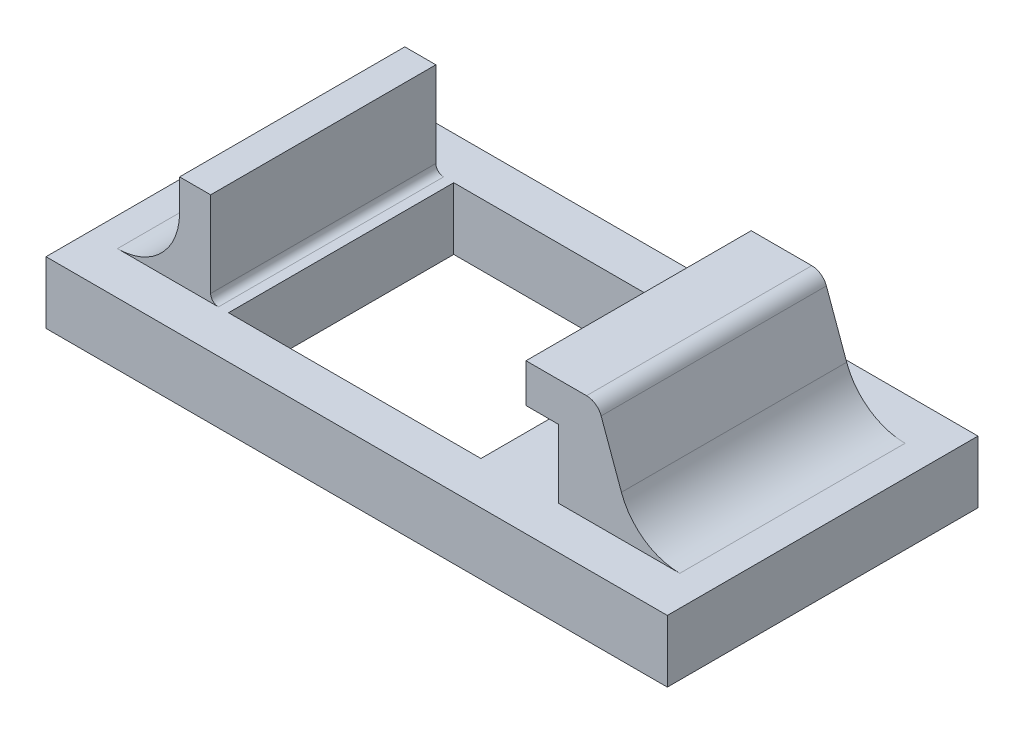
ISO-10303-21;
HEADER;
FILE_DESCRIPTION(('STEP AP214'),'2;1');
FILE_NAME('part.step','',(''),(''),'','','');
FILE_SCHEMA(('AUTOMOTIVE_DESIGN { 1 0 10303 214 1 1 1 1 }'));
ENDSEC;
DATA;
#1=APPLICATION_CONTEXT('core data for automotive mechanical design processes');
#2=APPLICATION_PROTOCOL_DEFINITION('international standard','automotive_design',2000,#1);
#3=PRODUCT_CONTEXT('',#1,'mechanical');
#4=PRODUCT('Part','Part','',(#3));
#5=PRODUCT_RELATED_PRODUCT_CATEGORY('part','',(#4));
#6=PRODUCT_DEFINITION_FORMATION('','',#4);
#7=PRODUCT_DEFINITION_CONTEXT('part definition',#1,'design');
#8=PRODUCT_DEFINITION('design','',#6,#7);
#9=PRODUCT_DEFINITION_SHAPE('','',#8);
#10=(LENGTH_UNIT() NAMED_UNIT(*) SI_UNIT(.MILLI.,.METRE.));
#11=(NAMED_UNIT(*) PLANE_ANGLE_UNIT() SI_UNIT($,.RADIAN.));
#12=(NAMED_UNIT(*) SI_UNIT($,.STERADIAN.) SOLID_ANGLE_UNIT());
#13=UNCERTAINTY_MEASURE_WITH_UNIT(LENGTH_MEASURE(1.E-05),#10,'distance_accuracy_value','');
#14=(GEOMETRIC_REPRESENTATION_CONTEXT(3) GLOBAL_UNCERTAINTY_ASSIGNED_CONTEXT((#13)) GLOBAL_UNIT_ASSIGNED_CONTEXT((#10,
#11,#12)) REPRESENTATION_CONTEXT('',''));
#15=CARTESIAN_POINT('',(0.,0.,0.));
#16=DIRECTION('',(0.,0.,1.));
#17=DIRECTION('',(1.,0.,0.));
#18=AXIS2_PLACEMENT_3D('',#15,#16,#17);
#19=CARTESIAN_POINT('',(0.,4.,0.));
#20=DIRECTION('',(0.,1.,0.));
#21=DIRECTION('',(0.,0.,1.));
#22=AXIS2_PLACEMENT_3D('',#19,#20,#21);
#23=PLANE('',#22);
#24=DIRECTION('',(0.,0.,1.));
#25=VECTOR('',#24,1.);
#26=CARTESIAN_POINT('',(18.0551810160948,4.,7.25));
#27=LINE('',#26,#25);
#28=CARTESIAN_POINT('',(18.0551810160948,4.,-7.25));
#29=VERTEX_POINT('',#28);
#30=CARTESIAN_POINT('',(18.0551810160948,4.,7.25));
#31=VERTEX_POINT('',#30);
#32=EDGE_CURVE('E450',#29,#31,#27,.T.);
#33=ORIENTED_EDGE('',*,*,#32,.T.);
#34=DIRECTION('',(1.,0.,0.));
#35=VECTOR('',#34,1.);
#36=CARTESIAN_POINT('',(10.25,4.,7.25));
#37=LINE('',#36,#35);
#38=CARTESIAN_POINT('',(10.25,4.,7.25));
#39=VERTEX_POINT('',#38);
#40=EDGE_CURVE('E255',#39,#31,#37,.T.);
#41=ORIENTED_EDGE('',*,*,#40,.F.);
#42=DIRECTION('',(0.,0.,1.));
#43=VECTOR('',#42,1.);
#44=CARTESIAN_POINT('',(10.25,4.,-7.25));
#45=LINE('',#44,#43);
#46=CARTESIAN_POINT('',(10.25,4.,-7.25));
#47=VERTEX_POINT('',#46);
#48=EDGE_CURVE('E222',#47,#39,#45,.T.);
#49=ORIENTED_EDGE('',*,*,#48,.F.);
#50=DIRECTION('',(-1.,0.,0.));
#51=VECTOR('',#50,1.);
#52=CARTESIAN_POINT('',(10.25,4.,-7.25));
#53=LINE('',#52,#51);
#54=EDGE_CURVE('E251',#29,#47,#53,.T.);
#55=ORIENTED_EDGE('',*,*,#54,.F.);
#56=EDGE_LOOP('',(#33,#41,#49,#55));
#57=FACE_BOUND('',#56,.T.);
#58=DIRECTION('',(0.,0.,-1.));
#59=VECTOR('',#58,1.);
#60=CARTESIAN_POINT('',(5.25,4.,-7.25));
#61=LINE('',#60,#59);
#62=CARTESIAN_POINT('',(5.25,4.,7.25));
#63=VERTEX_POINT('',#62);
#64=CARTESIAN_POINT('',(5.25,4.,-7.25));
#65=VERTEX_POINT('',#64);
#66=EDGE_CURVE('E325',#63,#65,#61,.T.);
#67=ORIENTED_EDGE('',*,*,#66,.F.);
#68=DIRECTION('',(1.,0.,0.));
#69=VECTOR('',#68,1.);
#70=CARTESIAN_POINT('',(-11.,4.,7.25));
#71=LINE('',#70,#69);
#72=CARTESIAN_POINT('',(-11.,4.,7.25));
#73=VERTEX_POINT('',#72);
#74=EDGE_CURVE('E333',#73,#63,#71,.T.);
#75=ORIENTED_EDGE('',*,*,#74,.F.);
#76=DIRECTION('',(0.,0.,1.));
#77=VECTOR('',#76,1.);
#78=CARTESIAN_POINT('',(-11.,4.,-7.25));
#79=LINE('',#78,#77);
#80=CARTESIAN_POINT('',(-11.,4.,-7.25));
#81=VERTEX_POINT('',#80);
#82=EDGE_CURVE('E347',#81,#73,#79,.T.);
#83=ORIENTED_EDGE('',*,*,#82,.F.);
#84=DIRECTION('',(-1.,0.,0.));
#85=VECTOR('',#84,1.);
#86=CARTESIAN_POINT('',(-11.,4.,-7.25));
#87=LINE('',#86,#85);
#88=EDGE_CURVE('E343',#65,#81,#87,.T.);
#89=ORIENTED_EDGE('',*,*,#88,.F.);
#90=EDGE_LOOP('',(#67,#75,#83,#89));
#91=FACE_BOUND('',#90,.T.);
#92=DIRECTION('',(0.,0.,-1.));
#93=VECTOR('',#92,1.);
#94=CARTESIAN_POINT('',(20.,4.,-9.99999999999999));
#95=LINE('',#94,#93);
#96=CARTESIAN_POINT('',(20.,4.,10.));
#97=VERTEX_POINT('',#96);
#98=CARTESIAN_POINT('',(20.,4.,-9.99999999999999));
#99=VERTEX_POINT('',#98);
#100=EDGE_CURVE('E367',#97,#99,#95,.T.);
#101=ORIENTED_EDGE('',*,*,#100,.T.);
#102=DIRECTION('',(-1.,0.,0.));
#103=VECTOR('',#102,1.);
#104=CARTESIAN_POINT('',(-20.,4.,-9.99999999999999));
#105=LINE('',#104,#103);
#106=CARTESIAN_POINT('',(-20.,4.,-9.99999999999999));
#107=VERTEX_POINT('',#106);
#108=EDGE_CURVE('E371',#99,#107,#105,.T.);
#109=ORIENTED_EDGE('',*,*,#108,.T.);
#110=DIRECTION('',(0.,0.,1.));
#111=VECTOR('',#110,1.);
#112=CARTESIAN_POINT('',(-20.,4.,-9.99999999999999));
#113=LINE('',#112,#111);
#114=CARTESIAN_POINT('',(-20.,4.,10.));
#115=VERTEX_POINT('',#114);
#116=EDGE_CURVE('E375',#107,#115,#113,.T.);
#117=ORIENTED_EDGE('',*,*,#116,.T.);
#118=DIRECTION('',(1.,0.,0.));
#119=VECTOR('',#118,1.);
#120=CARTESIAN_POINT('',(-20.,4.,10.));
#121=LINE('',#120,#119);
#122=EDGE_CURVE('E378',#115,#97,#121,.T.);
#123=ORIENTED_EDGE('',*,*,#122,.T.);
#124=EDGE_LOOP('',(#101,#109,#117,#123));
#125=FACE_BOUND('',#124,.T.);
#126=DIRECTION('',(-1.,0.,0.));
#127=VECTOR('',#126,1.);
#128=CARTESIAN_POINT('',(-12.15,4.,-7.25));
#129=LINE('',#128,#127);
#130=CARTESIAN_POINT('',(-11.65,4.,-7.25));
#131=VERTEX_POINT('',#130);
#132=CARTESIAN_POINT('',(-18.15,4.,-7.25));
#133=VERTEX_POINT('',#132);
#134=EDGE_CURVE('E266',#131,#133,#129,.T.);
#135=ORIENTED_EDGE('',*,*,#134,.F.);
#136=DIRECTION('',(0.,0.,-1.));
#137=VECTOR('',#136,1.);
#138=CARTESIAN_POINT('',(-11.65,4.,0.));
#139=LINE('',#138,#137);
#140=CARTESIAN_POINT('',(-11.65,4.,7.25));
#141=VERTEX_POINT('',#140);
#142=EDGE_CURVE('E427',#131,#141,#139,.F.);
#143=ORIENTED_EDGE('',*,*,#142,.T.);
#144=DIRECTION('',(1.,0.,0.));
#145=VECTOR('',#144,1.);
#146=CARTESIAN_POINT('',(-12.15,4.,7.25));
#147=LINE('',#146,#145);
#148=CARTESIAN_POINT('',(-18.15,4.,7.25));
#149=VERTEX_POINT('',#148);
#150=EDGE_CURVE('E272',#149,#141,#147,.T.);
#151=ORIENTED_EDGE('',*,*,#150,.F.);
#152=DIRECTION('',(0.,0.,1.));
#153=VECTOR('',#152,1.);
#154=CARTESIAN_POINT('',(-18.15,4.,0.));
#155=LINE('',#154,#153);
#156=EDGE_CURVE('E412',#149,#133,#155,.F.);
#157=ORIENTED_EDGE('',*,*,#156,.T.);
#158=EDGE_LOOP('',(#135,#143,#151,#157));
#159=FACE_BOUND('',#158,.T.);
#160=ADVANCED_FACE('F39',(#57,#91,#125,#159),#23,.T.);
#161=CARTESIAN_POINT('',(20.,4.,-9.99999999999999));
#162=DIRECTION('',(-1.,0.,0.));
#163=DIRECTION('',(0.,0.,1.));
#164=AXIS2_PLACEMENT_3D('',#161,#162,#163);
#165=PLANE('',#164);
#166=DIRECTION('',(0.,0.,-1.));
#167=VECTOR('',#166,1.);
#168=CARTESIAN_POINT('',(20.,0.,-9.99999999999999));
#169=LINE('',#168,#167);
#170=CARTESIAN_POINT('',(20.,0.,10.));
#171=VERTEX_POINT('',#170);
#172=CARTESIAN_POINT('',(20.,0.,-9.99999999999999));
#173=VERTEX_POINT('',#172);
#174=EDGE_CURVE('E357',#171,#173,#169,.T.);
#175=ORIENTED_EDGE('',*,*,#174,.T.);
#176=DIRECTION('',(0.,-1.,0.));
#177=VECTOR('',#176,1.);
#178=CARTESIAN_POINT('',(20.,4.,-9.99999999999999));
#179=LINE('',#178,#177);
#180=EDGE_CURVE('E404',#99,#173,#179,.T.);
#181=ORIENTED_EDGE('',*,*,#180,.F.);
#182=ORIENTED_EDGE('',*,*,#100,.F.);
#183=DIRECTION('',(0.,-1.,0.));
#184=VECTOR('',#183,1.);
#185=CARTESIAN_POINT('',(20.,4.,10.));
#186=LINE('',#185,#184);
#187=EDGE_CURVE('E381',#97,#171,#186,.T.);
#188=ORIENTED_EDGE('',*,*,#187,.T.);
#189=EDGE_LOOP('',(#175,#181,#182,#188));
#190=FACE_BOUND('',#189,.T.);
#191=ADVANCED_FACE('F482',(#190),#165,.F.);
#192=CARTESIAN_POINT('',(-20.,4.,-9.99999999999999));
#193=DIRECTION('',(0.,0.,1.));
#194=DIRECTION('',(1.,0.,0.));
#195=AXIS2_PLACEMENT_3D('',#192,#193,#194);
#196=PLANE('',#195);
#197=DIRECTION('',(-1.,0.,0.));
#198=VECTOR('',#197,1.);
#199=CARTESIAN_POINT('',(-20.,0.,-9.99999999999999));
#200=LINE('',#199,#198);
#201=CARTESIAN_POINT('',(-20.,0.,-9.99999999999999));
#202=VERTEX_POINT('',#201);
#203=EDGE_CURVE('E385',#173,#202,#200,.T.);
#204=ORIENTED_EDGE('',*,*,#203,.T.);
#205=DIRECTION('',(0.,-1.,0.));
#206=VECTOR('',#205,1.);
#207=CARTESIAN_POINT('',(-20.,4.,-9.99999999999999));
#208=LINE('',#207,#206);
#209=EDGE_CURVE('E400',#107,#202,#208,.T.);
#210=ORIENTED_EDGE('',*,*,#209,.F.);
#211=ORIENTED_EDGE('',*,*,#108,.F.);
#212=ORIENTED_EDGE('',*,*,#180,.T.);
#213=EDGE_LOOP('',(#204,#210,#211,#212));
#214=FACE_BOUND('',#213,.T.);
#215=ADVANCED_FACE('F487',(#214),#196,.F.);
#216=CARTESIAN_POINT('',(-20.,4.,-9.99999999999999));
#217=DIRECTION('',(1.,0.,0.));
#218=DIRECTION('',(0.,0.,-1.));
#219=AXIS2_PLACEMENT_3D('',#216,#217,#218);
#220=PLANE('',#219);
#221=DIRECTION('',(0.,0.,1.));
#222=VECTOR('',#221,1.);
#223=CARTESIAN_POINT('',(-20.,0.,-9.99999999999999));
#224=LINE('',#223,#222);
#225=CARTESIAN_POINT('',(-20.,0.,10.));
#226=VERTEX_POINT('',#225);
#227=EDGE_CURVE('E388',#202,#226,#224,.T.);
#228=ORIENTED_EDGE('',*,*,#227,.T.);
#229=DIRECTION('',(0.,-1.,0.));
#230=VECTOR('',#229,1.);
#231=CARTESIAN_POINT('',(-20.,4.,10.));
#232=LINE('',#231,#230);
#233=EDGE_CURVE('E396',#115,#226,#232,.T.);
#234=ORIENTED_EDGE('',*,*,#233,.F.);
#235=ORIENTED_EDGE('',*,*,#116,.F.);
#236=ORIENTED_EDGE('',*,*,#209,.T.);
#237=EDGE_LOOP('',(#228,#234,#235,#236));
#238=FACE_BOUND('',#237,.T.);
#239=ADVANCED_FACE('F501',(#238),#220,.F.);
#240=CARTESIAN_POINT('',(-20.,4.,10.));
#241=DIRECTION('',(0.,0.,-1.));
#242=DIRECTION('',(-1.,0.,0.));
#243=AXIS2_PLACEMENT_3D('',#240,#241,#242);
#244=PLANE('',#243);
#245=DIRECTION('',(1.,0.,0.));
#246=VECTOR('',#245,1.);
#247=CARTESIAN_POINT('',(-20.,0.,10.));
#248=LINE('',#247,#246);
#249=EDGE_CURVE('E372',#226,#171,#248,.T.);
#250=ORIENTED_EDGE('',*,*,#249,.T.);
#251=ORIENTED_EDGE('',*,*,#187,.F.);
#252=ORIENTED_EDGE('',*,*,#122,.F.);
#253=ORIENTED_EDGE('',*,*,#233,.T.);
#254=EDGE_LOOP('',(#250,#251,#252,#253));
#255=FACE_BOUND('',#254,.T.);
#256=ADVANCED_FACE('F497',(#255),#244,.F.);
#257=CARTESIAN_POINT('',(0.,0.,0.));
#258=DIRECTION('',(0.,1.,0.));
#259=DIRECTION('',(0.,0.,1.));
#260=AXIS2_PLACEMENT_3D('',#257,#258,#259);
#261=PLANE('',#260);
#262=DIRECTION('',(-1.,0.,0.));
#263=VECTOR('',#262,1.);
#264=CARTESIAN_POINT('',(-11.,0.,-7.25));
#265=LINE('',#264,#263);
#266=CARTESIAN_POINT('',(4.25,0.,-7.25));
#267=VERTEX_POINT('',#266);
#268=CARTESIAN_POINT('',(-11.,0.,-7.25));
#269=VERTEX_POINT('',#268);
#270=EDGE_CURVE('E314',#267,#269,#265,.T.);
#271=ORIENTED_EDGE('',*,*,#270,.T.);
#272=DIRECTION('',(0.,0.,1.));
#273=VECTOR('',#272,1.);
#274=CARTESIAN_POINT('',(-11.,0.,-7.25));
#275=LINE('',#274,#273);
#276=CARTESIAN_POINT('',(-11.,0.,7.25));
#277=VERTEX_POINT('',#276);
#278=EDGE_CURVE('E302',#269,#277,#275,.T.);
#279=ORIENTED_EDGE('',*,*,#278,.T.);
#280=DIRECTION('',(1.,0.,0.));
#281=VECTOR('',#280,1.);
#282=CARTESIAN_POINT('',(-11.,0.,7.25));
#283=LINE('',#282,#281);
#284=CARTESIAN_POINT('',(4.25,0.,7.25));
#285=VERTEX_POINT('',#284);
#286=EDGE_CURVE('E306',#277,#285,#283,.T.);
#287=ORIENTED_EDGE('',*,*,#286,.T.);
#288=DIRECTION('',(0.,0.,-1.));
#289=VECTOR('',#288,1.);
#290=CARTESIAN_POINT('',(4.25,0.,-7.25));
#291=LINE('',#290,#289);
#292=EDGE_CURVE('E310',#285,#267,#291,.T.);
#293=ORIENTED_EDGE('',*,*,#292,.T.);
#294=EDGE_LOOP('',(#271,#279,#287,#293));
#295=FACE_BOUND('',#294,.T.);
#296=ORIENTED_EDGE('',*,*,#174,.F.);
#297=ORIENTED_EDGE('',*,*,#249,.F.);
#298=ORIENTED_EDGE('',*,*,#227,.F.);
#299=ORIENTED_EDGE('',*,*,#203,.F.);
#300=EDGE_LOOP('',(#296,#297,#298,#299));
#301=FACE_BOUND('',#300,.T.);
#302=ADVANCED_FACE('F494',(#295,#301),#261,.F.);
#303=CARTESIAN_POINT('',(5.25,0.5,-7.25));
#304=DIRECTION('',(1.,0.,0.));
#305=DIRECTION('',(0.,0.,-1.));
#306=AXIS2_PLACEMENT_3D('',#303,#304,#305);
#307=PLANE('',#306);
#308=ORIENTED_EDGE('',*,*,#66,.T.);
#309=DIRECTION('',(0.,1.,0.));
#310=VECTOR('',#309,1.);
#311=CARTESIAN_POINT('',(5.25,0.5,-7.25));
#312=LINE('',#311,#310);
#313=CARTESIAN_POINT('',(5.25,0.5,-7.25));
#314=VERTEX_POINT('',#313);
#315=EDGE_CURVE('E340',#314,#65,#312,.T.);
#316=ORIENTED_EDGE('',*,*,#315,.F.);
#317=DIRECTION('',(0.,0.,-1.));
#318=VECTOR('',#317,1.);
#319=CARTESIAN_POINT('',(5.25,0.5,-7.25));
#320=LINE('',#319,#318);
#321=CARTESIAN_POINT('',(5.25,0.5,7.25));
#322=VERTEX_POINT('',#321);
#323=EDGE_CURVE('E328',#322,#314,#320,.T.);
#324=ORIENTED_EDGE('',*,*,#323,.F.);
#325=DIRECTION('',(0.,1.,0.));
#326=VECTOR('',#325,1.);
#327=CARTESIAN_POINT('',(5.25,0.5,7.25));
#328=LINE('',#327,#326);
#329=EDGE_CURVE('E354',#322,#63,#328,.T.);
#330=ORIENTED_EDGE('',*,*,#329,.T.);
#331=EDGE_LOOP('',(#308,#316,#324,#330));
#332=FACE_BOUND('',#331,.T.);
#333=ADVANCED_FACE('F492',(#332),#307,.F.);
#334=CARTESIAN_POINT('',(-11.,0.5,7.25));
#335=DIRECTION('',(0.,0.,1.));
#336=DIRECTION('',(1.,0.,0.));
#337=AXIS2_PLACEMENT_3D('',#334,#335,#336);
#338=PLANE('',#337);
#339=ORIENTED_EDGE('',*,*,#74,.T.);
#340=ORIENTED_EDGE('',*,*,#329,.F.);
#341=DIRECTION('',(1.,0.,0.));
#342=VECTOR('',#341,1.);
#343=CARTESIAN_POINT('',(-11.,0.5,7.25));
#344=LINE('',#343,#342);
#345=CARTESIAN_POINT('',(4.25,0.5,7.25));
#346=VERTEX_POINT('',#345);
#347=EDGE_CURVE('E337',#346,#322,#344,.T.);
#348=ORIENTED_EDGE('',*,*,#347,.F.);
#349=DIRECTION('',(0.,1.,0.));
#350=VECTOR('',#349,1.);
#351=CARTESIAN_POINT('',(4.25,0.,7.25));
#352=LINE('',#351,#350);
#353=EDGE_CURVE('E318',#285,#346,#352,.T.);
#354=ORIENTED_EDGE('',*,*,#353,.F.);
#355=ORIENTED_EDGE('',*,*,#286,.F.);
#356=DIRECTION('',(0.,1.,0.));
#357=VECTOR('',#356,1.);
#358=CARTESIAN_POINT('',(-11.,0.5,7.25));
#359=LINE('',#358,#357);
#360=EDGE_CURVE('E358',#277,#73,#359,.T.);
#361=ORIENTED_EDGE('',*,*,#360,.T.);
#362=EDGE_LOOP('',(#339,#340,#348,#354,#355,#361));
#363=FACE_BOUND('',#362,.T.);
#364=ADVANCED_FACE('F564',(#363),#338,.F.);
#365=CARTESIAN_POINT('',(-11.,0.5,-7.25));
#366=DIRECTION('',(-1.,0.,0.));
#367=DIRECTION('',(0.,0.,1.));
#368=AXIS2_PLACEMENT_3D('',#365,#366,#367);
#369=PLANE('',#368);
#370=ORIENTED_EDGE('',*,*,#82,.T.);
#371=ORIENTED_EDGE('',*,*,#360,.F.);
#372=ORIENTED_EDGE('',*,*,#278,.F.);
#373=DIRECTION('',(0.,1.,0.));
#374=VECTOR('',#373,1.);
#375=CARTESIAN_POINT('',(-11.,0.5,-7.25));
#376=LINE('',#375,#374);
#377=EDGE_CURVE('E361',#269,#81,#376,.T.);
#378=ORIENTED_EDGE('',*,*,#377,.T.);
#379=EDGE_LOOP('',(#370,#371,#372,#378));
#380=FACE_BOUND('',#379,.T.);
#381=ADVANCED_FACE('F567',(#380),#369,.F.);
#382=CARTESIAN_POINT('',(-11.,0.5,-7.25));
#383=DIRECTION('',(0.,0.,-1.));
#384=DIRECTION('',(-1.,0.,0.));
#385=AXIS2_PLACEMENT_3D('',#382,#383,#384);
#386=PLANE('',#385);
#387=ORIENTED_EDGE('',*,*,#88,.T.);
#388=ORIENTED_EDGE('',*,*,#377,.F.);
#389=ORIENTED_EDGE('',*,*,#270,.F.);
#390=DIRECTION('',(0.,1.,0.));
#391=VECTOR('',#390,1.);
#392=CARTESIAN_POINT('',(4.25,0.,-7.25));
#393=LINE('',#392,#391);
#394=CARTESIAN_POINT('',(4.25,0.5,-7.25));
#395=VERTEX_POINT('',#394);
#396=EDGE_CURVE('E322',#267,#395,#393,.T.);
#397=ORIENTED_EDGE('',*,*,#396,.T.);
#398=DIRECTION('',(-1.,0.,0.));
#399=VECTOR('',#398,1.);
#400=CARTESIAN_POINT('',(-11.,0.5,-7.25));
#401=LINE('',#400,#399);
#402=EDGE_CURVE('E332',#314,#395,#401,.T.);
#403=ORIENTED_EDGE('',*,*,#402,.F.);
#404=ORIENTED_EDGE('',*,*,#315,.T.);
#405=EDGE_LOOP('',(#387,#388,#389,#397,#403,#404));
#406=FACE_BOUND('',#405,.T.);
#407=ADVANCED_FACE('F562',(#406),#386,.F.);
#408=CARTESIAN_POINT('',(0.,0.5,0.));
#409=DIRECTION('',(0.,1.,0.));
#410=DIRECTION('',(0.,0.,1.));
#411=AXIS2_PLACEMENT_3D('',#408,#409,#410);
#412=PLANE('',#411);
#413=DIRECTION('',(0.,0.,-1.));
#414=VECTOR('',#413,1.);
#415=CARTESIAN_POINT('',(4.25,0.5,-7.25));
#416=LINE('',#415,#414);
#417=EDGE_CURVE('E301',#346,#395,#416,.T.);
#418=ORIENTED_EDGE('',*,*,#417,.F.);
#419=ORIENTED_EDGE('',*,*,#347,.T.);
#420=ORIENTED_EDGE('',*,*,#323,.T.);
#421=ORIENTED_EDGE('',*,*,#402,.T.);
#422=EDGE_LOOP('',(#418,#419,#420,#421));
#423=FACE_BOUND('',#422,.T.);
#424=ADVANCED_FACE('F558',(#423),#412,.T.);
#425=CARTESIAN_POINT('',(4.25,0.,-7.25));
#426=DIRECTION('',(1.,0.,0.));
#427=DIRECTION('',(0.,0.,-1.));
#428=AXIS2_PLACEMENT_3D('',#425,#426,#427);
#429=PLANE('',#428);
#430=ORIENTED_EDGE('',*,*,#417,.T.);
#431=ORIENTED_EDGE('',*,*,#396,.F.);
#432=ORIENTED_EDGE('',*,*,#292,.F.);
#433=ORIENTED_EDGE('',*,*,#353,.T.);
#434=EDGE_LOOP('',(#430,#431,#432,#433));
#435=FACE_BOUND('',#434,.T.);
#436=ADVANCED_FACE('F552',(#435),#429,.F.);
#437=CARTESIAN_POINT('',(-12.15,10.,-7.25));
#438=DIRECTION('',(-1.,0.,0.));
#439=DIRECTION('',(0.,0.,1.));
#440=AXIS2_PLACEMENT_3D('',#437,#438,#439);
#441=PLANE('',#440);
#442=DIRECTION('',(0.,-1.,0.));
#443=VECTOR('',#442,1.);
#444=CARTESIAN_POINT('',(-12.15,10.,7.25));
#445=LINE('',#444,#443);
#446=CARTESIAN_POINT('',(-12.15,10.,7.25));
#447=VERTEX_POINT('',#446);
#448=CARTESIAN_POINT('',(-12.15,4.5,7.25));
#449=VERTEX_POINT('',#448);
#450=EDGE_CURVE('E281',#447,#449,#445,.T.);
#451=ORIENTED_EDGE('',*,*,#450,.T.);
#452=DIRECTION('',(0.,0.,-1.));
#453=VECTOR('',#452,1.);
#454=CARTESIAN_POINT('',(-12.15,4.5,-7.25));
#455=LINE('',#454,#453);
#456=CARTESIAN_POINT('',(-12.15,4.5,-7.25));
#457=VERTEX_POINT('',#456);
#458=EDGE_CURVE('E423',#449,#457,#455,.T.);
#459=ORIENTED_EDGE('',*,*,#458,.T.);
#460=DIRECTION('',(0.,-1.,0.));
#461=VECTOR('',#460,1.);
#462=CARTESIAN_POINT('',(-12.15,10.,-7.25));
#463=LINE('',#462,#461);
#464=CARTESIAN_POINT('',(-12.15,10.,-7.25));
#465=VERTEX_POINT('',#464);
#466=EDGE_CURVE('E297',#465,#457,#463,.T.);
#467=ORIENTED_EDGE('',*,*,#466,.F.);
#468=DIRECTION('',(0.,0.,-1.));
#469=VECTOR('',#468,1.);
#470=CARTESIAN_POINT('',(-12.15,10.,-7.25));
#471=LINE('',#470,#469);
#472=EDGE_CURVE('E267',#447,#465,#471,.T.);
#473=ORIENTED_EDGE('',*,*,#472,.F.);
#474=EDGE_LOOP('',(#451,#459,#467,#473));
#475=FACE_BOUND('',#474,.T.);
#476=ADVANCED_FACE('F531',(#475),#441,.F.);
#477=CARTESIAN_POINT('',(-12.15,10.,-7.25));
#478=DIRECTION('',(0.,0.,1.));
#479=DIRECTION('',(1.,0.,0.));
#480=AXIS2_PLACEMENT_3D('',#477,#478,#479);
#481=PLANE('',#480);
#482=ORIENTED_EDGE('',*,*,#134,.T.);
#483=CARTESIAN_POINT('',(-18.15,8.,-7.25));
#484=DIRECTION('',(0.,0.,1.));
#485=DIRECTION('',(1.,0.,0.));
#486=AXIS2_PLACEMENT_3D('',#483,#484,#485);
#487=CIRCLE('',#486,4.);
#488=CARTESIAN_POINT('',(-14.15,8.,-7.25));
#489=VERTEX_POINT('',#488);
#490=EDGE_CURVE('E420',#133,#489,#487,.T.);
#491=ORIENTED_EDGE('',*,*,#490,.T.);
#492=DIRECTION('',(0.,-1.,0.));
#493=VECTOR('',#492,1.);
#494=CARTESIAN_POINT('',(-14.15,10.,-7.25));
#495=LINE('',#494,#493);
#496=CARTESIAN_POINT('',(-14.15,10.,-7.25));
#497=VERTEX_POINT('',#496);
#498=EDGE_CURVE('E293',#497,#489,#495,.T.);
#499=ORIENTED_EDGE('',*,*,#498,.F.);
#500=DIRECTION('',(-1.,0.,0.));
#501=VECTOR('',#500,1.);
#502=CARTESIAN_POINT('',(-12.15,10.,-7.25));
#503=LINE('',#502,#501);
#504=EDGE_CURVE('E271',#465,#497,#503,.T.);
#505=ORIENTED_EDGE('',*,*,#504,.F.);
#506=ORIENTED_EDGE('',*,*,#466,.T.);
#507=CARTESIAN_POINT('',(-11.65,4.5,-7.25));
#508=DIRECTION('',(0.,0.,1.));
#509=DIRECTION('',(1.,0.,0.));
#510=AXIS2_PLACEMENT_3D('',#507,#508,#509);
#511=CIRCLE('',#510,0.5);
#512=EDGE_CURVE('E431',#457,#131,#511,.T.);
#513=ORIENTED_EDGE('',*,*,#512,.T.);
#514=EDGE_LOOP('',(#482,#491,#499,#505,#506,#513));
#515=FACE_BOUND('',#514,.T.);
#516=ADVANCED_FACE('F544',(#515),#481,.F.);
#517=CARTESIAN_POINT('',(-14.15,10.,-7.25));
#518=DIRECTION('',(1.,0.,0.));
#519=DIRECTION('',(0.,0.,-1.));
#520=AXIS2_PLACEMENT_3D('',#517,#518,#519);
#521=PLANE('',#520);
#522=ORIENTED_EDGE('',*,*,#498,.T.);
#523=DIRECTION('',(0.,0.,1.));
#524=VECTOR('',#523,1.);
#525=CARTESIAN_POINT('',(-14.15,8.,-7.25));
#526=LINE('',#525,#524);
#527=CARTESIAN_POINT('',(-14.15,8.,7.25));
#528=VERTEX_POINT('',#527);
#529=EDGE_CURVE('E408',#489,#528,#526,.T.);
#530=ORIENTED_EDGE('',*,*,#529,.T.);
#531=DIRECTION('',(0.,-1.,0.));
#532=VECTOR('',#531,1.);
#533=CARTESIAN_POINT('',(-14.15,10.,7.25));
#534=LINE('',#533,#532);
#535=CARTESIAN_POINT('',(-14.15,10.,7.25));
#536=VERTEX_POINT('',#535);
#537=EDGE_CURVE('E289',#536,#528,#534,.T.);
#538=ORIENTED_EDGE('',*,*,#537,.F.);
#539=DIRECTION('',(0.,0.,1.));
#540=VECTOR('',#539,1.);
#541=CARTESIAN_POINT('',(-14.15,10.,-7.25));
#542=LINE('',#541,#540);
#543=EDGE_CURVE('E275',#497,#536,#542,.T.);
#544=ORIENTED_EDGE('',*,*,#543,.F.);
#545=EDGE_LOOP('',(#522,#530,#538,#544));
#546=FACE_BOUND('',#545,.T.);
#547=ADVANCED_FACE('F539',(#546),#521,.F.);
#548=CARTESIAN_POINT('',(-12.15,10.,7.25));
#549=DIRECTION('',(0.,0.,-1.));
#550=DIRECTION('',(-1.,0.,0.));
#551=AXIS2_PLACEMENT_3D('',#548,#549,#550);
#552=PLANE('',#551);
#553=ORIENTED_EDGE('',*,*,#150,.T.);
#554=CARTESIAN_POINT('',(-11.65,4.5,7.25));
#555=DIRECTION('',(0.,0.,-1.));
#556=DIRECTION('',(-1.,0.,0.));
#557=AXIS2_PLACEMENT_3D('',#554,#555,#556);
#558=CIRCLE('',#557,0.5);
#559=EDGE_CURVE('E435',#141,#449,#558,.T.);
#560=ORIENTED_EDGE('',*,*,#559,.T.);
#561=ORIENTED_EDGE('',*,*,#450,.F.);
#562=DIRECTION('',(1.,0.,0.));
#563=VECTOR('',#562,1.);
#564=CARTESIAN_POINT('',(-12.15,10.,7.25));
#565=LINE('',#564,#563);
#566=EDGE_CURVE('E278',#536,#447,#565,.T.);
#567=ORIENTED_EDGE('',*,*,#566,.F.);
#568=ORIENTED_EDGE('',*,*,#537,.T.);
#569=CARTESIAN_POINT('',(-18.15,8.,7.25));
#570=DIRECTION('',(0.,0.,-1.));
#571=DIRECTION('',(-1.,0.,0.));
#572=AXIS2_PLACEMENT_3D('',#569,#570,#571);
#573=CIRCLE('',#572,4.);
#574=EDGE_CURVE('E416',#528,#149,#573,.T.);
#575=ORIENTED_EDGE('',*,*,#574,.T.);
#576=EDGE_LOOP('',(#553,#560,#561,#567,#568,#575));
#577=FACE_BOUND('',#576,.T.);
#578=ADVANCED_FACE('F527',(#577),#552,.F.);
#579=CARTESIAN_POINT('',(0.,10.,0.));
#580=DIRECTION('',(0.,-1.,0.));
#581=DIRECTION('',(0.,0.,-1.));
#582=AXIS2_PLACEMENT_3D('',#579,#580,#581);
#583=PLANE('',#582);
#584=ORIENTED_EDGE('',*,*,#472,.T.);
#585=ORIENTED_EDGE('',*,*,#504,.T.);
#586=ORIENTED_EDGE('',*,*,#543,.T.);
#587=ORIENTED_EDGE('',*,*,#566,.T.);
#588=EDGE_LOOP('',(#584,#585,#586,#587));
#589=FACE_BOUND('',#588,.T.);
#590=ADVANCED_FACE('F512',(#589),#583,.F.);
#591=CARTESIAN_POINT('',(-18.15,8.,-7.25));
#592=DIRECTION('',(0.,0.,1.));
#593=DIRECTION('',(1.,0.,0.));
#594=AXIS2_PLACEMENT_3D('',#591,#592,#593);
#595=CYLINDRICAL_SURFACE('',#594,4.);
#596=ORIENTED_EDGE('',*,*,#490,.F.);
#597=ORIENTED_EDGE('',*,*,#156,.F.);
#598=ORIENTED_EDGE('',*,*,#574,.F.);
#599=ORIENTED_EDGE('',*,*,#529,.F.);
#600=EDGE_LOOP('',(#596,#597,#598,#599));
#601=FACE_BOUND('',#600,.T.);
#602=ADVANCED_FACE('F509',(#601),#595,.F.);
#603=CARTESIAN_POINT('',(-11.65,4.5,-7.25));
#604=DIRECTION('',(0.,0.,-1.));
#605=DIRECTION('',(-1.,0.,0.));
#606=AXIS2_PLACEMENT_3D('',#603,#604,#605);
#607=CYLINDRICAL_SURFACE('',#606,0.5);
#608=ORIENTED_EDGE('',*,*,#559,.F.);
#609=ORIENTED_EDGE('',*,*,#142,.F.);
#610=ORIENTED_EDGE('',*,*,#512,.F.);
#611=ORIENTED_EDGE('',*,*,#458,.F.);
#612=EDGE_LOOP('',(#608,#609,#610,#611));
#613=FACE_BOUND('',#612,.T.);
#614=ADVANCED_FACE('F511',(#613),#607,.F.);
#615=CARTESIAN_POINT('',(10.25,8.4,-7.25));
#616=DIRECTION('',(1.,0.,0.));
#617=DIRECTION('',(0.,0.,-1.));
#618=AXIS2_PLACEMENT_3D('',#615,#616,#617);
#619=PLANE('',#618);
#620=ORIENTED_EDGE('',*,*,#48,.T.);
#621=DIRECTION('',(0.,-1.,0.));
#622=VECTOR('',#621,1.);
#623=CARTESIAN_POINT('',(10.25,8.4,7.25));
#624=LINE('',#623,#622);
#625=CARTESIAN_POINT('',(10.25,8.4,7.25));
#626=VERTEX_POINT('',#625);
#627=EDGE_CURVE('E263',#626,#39,#624,.T.);
#628=ORIENTED_EDGE('',*,*,#627,.F.);
#629=DIRECTION('',(0.,0.,1.));
#630=VECTOR('',#629,1.);
#631=CARTESIAN_POINT('',(10.25,8.4,-7.25));
#632=LINE('',#631,#630);
#633=CARTESIAN_POINT('',(10.25,8.4,-7.25));
#634=VERTEX_POINT('',#633);
#635=EDGE_CURVE('E246',#634,#626,#632,.T.);
#636=ORIENTED_EDGE('',*,*,#635,.F.);
#637=DIRECTION('',(0.,-1.,0.));
#638=VECTOR('',#637,1.);
#639=CARTESIAN_POINT('',(10.25,8.4,-7.25));
#640=LINE('',#639,#638);
#641=EDGE_CURVE('E250',#634,#47,#640,.T.);
#642=ORIENTED_EDGE('',*,*,#641,.T.);
#643=EDGE_LOOP('',(#620,#628,#636,#642));
#644=FACE_BOUND('',#643,.T.);
#645=ADVANCED_FACE('F515',(#644),#619,.F.);
#646=CARTESIAN_POINT('',(10.25,8.4,7.25));
#647=DIRECTION('',(0.,0.,-1.));
#648=DIRECTION('',(-1.,0.,0.));
#649=AXIS2_PLACEMENT_3D('',#646,#647,#648);
#650=PLANE('',#649);
#651=ORIENTED_EDGE('',*,*,#40,.T.);
#652=CARTESIAN_POINT('',(18.0551810160948,8.,7.25));
#653=DIRECTION('',(0.,0.,-1.));
#654=DIRECTION('',(-1.,0.,0.));
#655=AXIS2_PLACEMENT_3D('',#652,#653,#654);
#656=CIRCLE('',#655,4.);
#657=CARTESIAN_POINT('',(14.2944185174637,6.63740489180032,7.25));
#658=VERTEX_POINT('',#657);
#659=EDGE_CURVE('E48',#31,#658,#656,.T.);
#660=ORIENTED_EDGE('',*,*,#659,.T.);
#661=DIRECTION('',(-0.340648777049921,0.940190624657783,0.));
#662=VECTOR('',#661,1.);
#663=CARTESIAN_POINT('',(12.75,10.9,7.25));
#664=LINE('',#663,#662);
#665=CARTESIAN_POINT('',(12.9888953706341,10.2406487770499,7.25));
#666=VERTEX_POINT('',#665);
#667=EDGE_CURVE('E465',#658,#666,#664,.T.);
#668=ORIENTED_EDGE('',*,*,#667,.T.);
#669=CARTESIAN_POINT('',(12.0487047459763,9.9,7.25));
#670=DIRECTION('',(0.,0.,-1.));
#671=DIRECTION('',(-1.,0.,0.));
#672=AXIS2_PLACEMENT_3D('',#669,#670,#671);
#673=CIRCLE('',#672,1.);
#674=CARTESIAN_POINT('',(12.0487047459763,10.9,7.25));
#675=VERTEX_POINT('',#674);
#676=EDGE_CURVE('E447',#666,#675,#673,.F.);
#677=ORIENTED_EDGE('',*,*,#676,.T.);
#678=DIRECTION('',(1.,0.,0.));
#679=VECTOR('',#678,1.);
#680=CARTESIAN_POINT('',(12.75,10.9,7.25));
#681=LINE('',#680,#679);
#682=CARTESIAN_POINT('',(8.15,10.9,7.25));
#683=VERTEX_POINT('',#682);
#684=EDGE_CURVE('E229',#683,#675,#681,.T.);
#685=ORIENTED_EDGE('',*,*,#684,.F.);
#686=DIRECTION('',(0.,-1.,0.));
#687=VECTOR('',#686,1.);
#688=CARTESIAN_POINT('',(8.15,10.9,7.25));
#689=LINE('',#688,#687);
#690=CARTESIAN_POINT('',(8.15,8.4,7.25));
#691=VERTEX_POINT('',#690);
#692=EDGE_CURVE('E223',#683,#691,#689,.T.);
#693=ORIENTED_EDGE('',*,*,#692,.T.);
#694=DIRECTION('',(1.,0.,0.));
#695=VECTOR('',#694,1.);
#696=CARTESIAN_POINT('',(12.75,8.4,7.25));
#697=LINE('',#696,#695);
#698=EDGE_CURVE('E212',#691,#626,#697,.T.);
#699=ORIENTED_EDGE('',*,*,#698,.T.);
#700=ORIENTED_EDGE('',*,*,#627,.T.);
#701=EDGE_LOOP('',(#651,#660,#668,#677,#685,#693,#699,#700));
#702=FACE_BOUND('',#701,.T.);
#703=ADVANCED_FACE('F468',(#702),#650,.F.);
#704=CARTESIAN_POINT('',(10.25,8.4,-7.25));
#705=DIRECTION('',(0.,0.,1.));
#706=DIRECTION('',(1.,0.,0.));
#707=AXIS2_PLACEMENT_3D('',#704,#705,#706);
#708=PLANE('',#707);
#709=DIRECTION('',(-1.,0.,0.));
#710=VECTOR('',#709,1.);
#711=CARTESIAN_POINT('',(12.75,10.9,-7.25));
#712=LINE('',#711,#710);
#713=CARTESIAN_POINT('',(12.0487047459763,10.9,-7.25));
#714=VERTEX_POINT('',#713);
#715=CARTESIAN_POINT('',(8.15,10.9,-7.25));
#716=VERTEX_POINT('',#715);
#717=EDGE_CURVE('E200',#714,#716,#712,.T.);
#718=ORIENTED_EDGE('',*,*,#717,.F.);
#719=CARTESIAN_POINT('',(12.0487047459763,9.9,-7.25));
#720=DIRECTION('',(0.,0.,1.));
#721=DIRECTION('',(1.,0.,0.));
#722=AXIS2_PLACEMENT_3D('',#719,#720,#721);
#723=CIRCLE('',#722,1.);
#724=CARTESIAN_POINT('',(12.9888953706341,10.2406487770499,-7.25));
#725=VERTEX_POINT('',#724);
#726=EDGE_CURVE('E440',#714,#725,#723,.F.);
#727=ORIENTED_EDGE('',*,*,#726,.T.);
#728=DIRECTION('',(-0.340648777049921,0.940190624657783,0.));
#729=VECTOR('',#728,1.);
#730=CARTESIAN_POINT('',(12.75,10.9,-7.25));
#731=LINE('',#730,#729);
#732=CARTESIAN_POINT('',(14.2944185174637,6.63740489180032,-7.25));
#733=VERTEX_POINT('',#732);
#734=EDGE_CURVE('E238',#733,#725,#731,.T.);
#735=ORIENTED_EDGE('',*,*,#734,.F.);
#736=CARTESIAN_POINT('',(18.0551810160948,8.,-7.25));
#737=DIRECTION('',(0.,0.,1.));
#738=DIRECTION('',(1.,0.,0.));
#739=AXIS2_PLACEMENT_3D('',#736,#737,#738);
#740=CIRCLE('',#739,4.);
#741=EDGE_CURVE('E11',#733,#29,#740,.T.);
#742=ORIENTED_EDGE('',*,*,#741,.T.);
#743=ORIENTED_EDGE('',*,*,#54,.T.);
#744=ORIENTED_EDGE('',*,*,#641,.F.);
#745=DIRECTION('',(-1.,0.,0.));
#746=VECTOR('',#745,1.);
#747=CARTESIAN_POINT('',(12.75,8.4,-7.25));
#748=LINE('',#747,#746);
#749=CARTESIAN_POINT('',(8.15,8.4,-7.25));
#750=VERTEX_POINT('',#749);
#751=EDGE_CURVE('E218',#634,#750,#748,.T.);
#752=ORIENTED_EDGE('',*,*,#751,.T.);
#753=DIRECTION('',(0.,-1.,0.));
#754=VECTOR('',#753,1.);
#755=CARTESIAN_POINT('',(8.15,10.9,-7.25));
#756=LINE('',#755,#754);
#757=EDGE_CURVE('E215',#716,#750,#756,.T.);
#758=ORIENTED_EDGE('',*,*,#757,.F.);
#759=EDGE_LOOP('',(#718,#727,#735,#742,#743,#744,#752,#758));
#760=FACE_BOUND('',#759,.T.);
#761=ADVANCED_FACE('F216',(#760),#708,.F.);
#762=CARTESIAN_POINT('',(8.15,10.9,-7.25));
#763=DIRECTION('',(1.,0.,0.));
#764=DIRECTION('',(0.,0.,-1.));
#765=AXIS2_PLACEMENT_3D('',#762,#763,#764);
#766=PLANE('',#765);
#767=DIRECTION('',(0.,0.,1.));
#768=VECTOR('',#767,1.);
#769=CARTESIAN_POINT('',(8.15,8.4,-7.25));
#770=LINE('',#769,#768);
#771=EDGE_CURVE('E237',#750,#691,#770,.T.);
#772=ORIENTED_EDGE('',*,*,#771,.T.);
#773=ORIENTED_EDGE('',*,*,#692,.F.);
#774=DIRECTION('',(0.,0.,1.));
#775=VECTOR('',#774,1.);
#776=CARTESIAN_POINT('',(8.15,10.9,-7.25));
#777=LINE('',#776,#775);
#778=EDGE_CURVE('E205',#716,#683,#777,.T.);
#779=ORIENTED_EDGE('',*,*,#778,.F.);
#780=ORIENTED_EDGE('',*,*,#757,.T.);
#781=EDGE_LOOP('',(#772,#773,#779,#780));
#782=FACE_BOUND('',#781,.T.);
#783=ADVANCED_FACE('F225',(#782),#766,.F.);
#784=CARTESIAN_POINT('',(0.,10.9,0.));
#785=DIRECTION('',(0.,-1.,0.));
#786=DIRECTION('',(0.,0.,-1.));
#787=AXIS2_PLACEMENT_3D('',#784,#785,#786);
#788=PLANE('',#787);
#789=ORIENTED_EDGE('',*,*,#684,.T.);
#790=DIRECTION('',(0.,0.,-1.));
#791=VECTOR('',#790,1.);
#792=CARTESIAN_POINT('',(12.0487047459763,10.9,-7.25));
#793=LINE('',#792,#791);
#794=EDGE_CURVE('E208',#675,#714,#793,.T.);
#795=ORIENTED_EDGE('',*,*,#794,.T.);
#796=ORIENTED_EDGE('',*,*,#717,.T.);
#797=ORIENTED_EDGE('',*,*,#778,.T.);
#798=EDGE_LOOP('',(#789,#795,#796,#797));
#799=FACE_BOUND('',#798,.T.);
#800=ADVANCED_FACE('F203',(#799),#788,.F.);
#801=CARTESIAN_POINT('',(0.,8.4,0.));
#802=DIRECTION('',(0.,-1.,0.));
#803=DIRECTION('',(0.,0.,-1.));
#804=AXIS2_PLACEMENT_3D('',#801,#802,#803);
#805=PLANE('',#804);
#806=ORIENTED_EDGE('',*,*,#751,.F.);
#807=ORIENTED_EDGE('',*,*,#635,.T.);
#808=ORIENTED_EDGE('',*,*,#698,.F.);
#809=ORIENTED_EDGE('',*,*,#771,.F.);
#810=EDGE_LOOP('',(#806,#807,#808,#809));
#811=FACE_BOUND('',#810,.T.);
#812=ADVANCED_FACE('F478',(#811),#805,.T.);
#813=CARTESIAN_POINT('',(12.75,10.9,-7.25));
#814=DIRECTION('',(0.940190624657783,0.340648777049921,0.));
#815=DIRECTION('',(-0.340648777049921,0.940190624657783,0.));
#816=AXIS2_PLACEMENT_3D('',#813,#814,#815);
#817=PLANE('',#816);
#818=ORIENTED_EDGE('',*,*,#667,.F.);
#819=DIRECTION('',(0.,0.,1.));
#820=VECTOR('',#819,1.);
#821=CARTESIAN_POINT('',(14.2944185174637,6.63740489180031,-7.25));
#822=LINE('',#821,#820);
#823=EDGE_CURVE('E61',#658,#733,#822,.F.);
#824=ORIENTED_EDGE('',*,*,#823,.T.);
#825=ORIENTED_EDGE('',*,*,#734,.T.);
#826=DIRECTION('',(0.,0.,-1.));
#827=VECTOR('',#826,1.);
#828=CARTESIAN_POINT('',(12.9888953706341,10.2406487770499,7.25));
#829=LINE('',#828,#827);
#830=EDGE_CURVE('E443',#725,#666,#829,.F.);
#831=ORIENTED_EDGE('',*,*,#830,.T.);
#832=EDGE_LOOP('',(#818,#824,#825,#831));
#833=FACE_BOUND('',#832,.T.);
#834=ADVANCED_FACE('F470',(#833),#817,.T.);
#835=CARTESIAN_POINT('',(12.0487047459763,9.9,0.));
#836=DIRECTION('',(0.,0.,1.));
#837=DIRECTION('',(1.,0.,0.));
#838=AXIS2_PLACEMENT_3D('',#835,#836,#837);
#839=CYLINDRICAL_SURFACE('',#838,1.);
#840=ORIENTED_EDGE('',*,*,#676,.F.);
#841=ORIENTED_EDGE('',*,*,#830,.F.);
#842=ORIENTED_EDGE('',*,*,#726,.F.);
#843=ORIENTED_EDGE('',*,*,#794,.F.);
#844=EDGE_LOOP('',(#840,#841,#842,#843));
#845=FACE_BOUND('',#844,.T.);
#846=ADVANCED_FACE('F472',(#845),#839,.T.);
#847=CARTESIAN_POINT('',(18.0551810160948,8.,0.));
#848=DIRECTION('',(0.,0.,-1.));
#849=DIRECTION('',(-1.,0.,0.));
#850=AXIS2_PLACEMENT_3D('',#847,#848,#849);
#851=CYLINDRICAL_SURFACE('',#850,4.);
#852=ORIENTED_EDGE('',*,*,#741,.F.);
#853=ORIENTED_EDGE('',*,*,#823,.F.);
#854=ORIENTED_EDGE('',*,*,#659,.F.);
#855=ORIENTED_EDGE('',*,*,#32,.F.);
#856=EDGE_LOOP('',(#852,#853,#854,#855));
#857=FACE_BOUND('',#856,.T.);
#858=ADVANCED_FACE('F41',(#857),#851,.F.);
#859=CLOSED_SHELL('',(#160,#191,#215,#239,#256,#302,#333,#364,#381,#407,#424,#436,#476,#516,
#547,#578,#590,#602,#614,#645,#703,#761,#783,#800,#812,#834,#846,#858));
#860=MANIFOLD_SOLID_BREP('B2',#859);
#861=ADVANCED_BREP_SHAPE_REPRESENTATION('',(#18,#860),#14);
#862=SHAPE_DEFINITION_REPRESENTATION(#9,#861);
ENDSEC;
END-ISO-10303-21;
